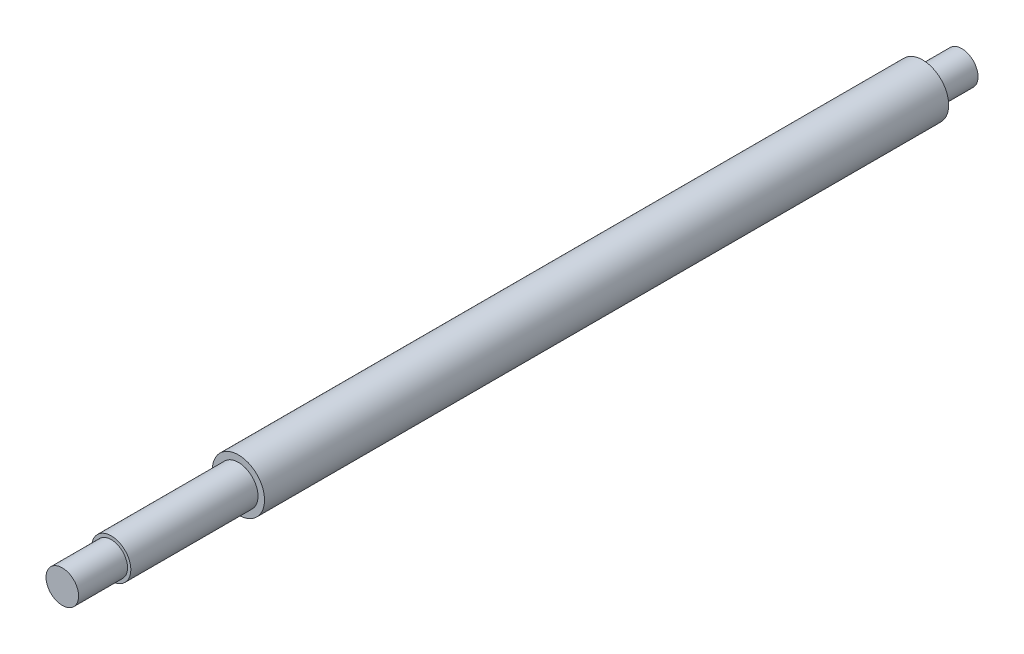
ISO-10303-21;
HEADER;
FILE_DESCRIPTION(('STEP AP214'),'2;1');
FILE_NAME('part.step','',(''),(''),'','','');
FILE_SCHEMA(('AUTOMOTIVE_DESIGN { 1 0 10303 214 1 1 1 1 }'));
ENDSEC;
DATA;
#1=APPLICATION_CONTEXT('core data for automotive mechanical design processes');
#2=APPLICATION_PROTOCOL_DEFINITION('international standard','automotive_design',2000,#1);
#3=PRODUCT_CONTEXT('',#1,'mechanical');
#4=PRODUCT('Part','Part','',(#3));
#5=PRODUCT_RELATED_PRODUCT_CATEGORY('part','',(#4));
#6=PRODUCT_DEFINITION_FORMATION('','',#4);
#7=PRODUCT_DEFINITION_CONTEXT('part definition',#1,'design');
#8=PRODUCT_DEFINITION('design','',#6,#7);
#9=PRODUCT_DEFINITION_SHAPE('','',#8);
#10=(LENGTH_UNIT() NAMED_UNIT(*) SI_UNIT(.MILLI.,.METRE.));
#11=(NAMED_UNIT(*) PLANE_ANGLE_UNIT() SI_UNIT($,.RADIAN.));
#12=(NAMED_UNIT(*) SI_UNIT($,.STERADIAN.) SOLID_ANGLE_UNIT());
#13=UNCERTAINTY_MEASURE_WITH_UNIT(LENGTH_MEASURE(1.E-05),#10,'distance_accuracy_value','');
#14=(GEOMETRIC_REPRESENTATION_CONTEXT(3) GLOBAL_UNCERTAINTY_ASSIGNED_CONTEXT((#13)) GLOBAL_UNIT_ASSIGNED_CONTEXT((#10,
#11,#12)) REPRESENTATION_CONTEXT('',''));
#15=CARTESIAN_POINT('',(0.,0.,0.));
#16=DIRECTION('',(0.,0.,1.));
#17=DIRECTION('',(1.,0.,0.));
#18=AXIS2_PLACEMENT_3D('',#15,#16,#17);
#19=CARTESIAN_POINT('',(0.,0.,275.75));
#20=DIRECTION('',(0.,0.,1.));
#21=DIRECTION('',(1.,0.,0.));
#22=AXIS2_PLACEMENT_3D('',#19,#20,#21);
#23=PLANE('',#22);
#24=CARTESIAN_POINT('',(0.,0.,275.75));
#25=DIRECTION('',(0.,0.,-1.));
#26=DIRECTION('',(-1.,0.,0.));
#27=AXIS2_PLACEMENT_3D('',#24,#25,#26);
#28=CIRCLE('',#27,4.99999999999995);
#29=CARTESIAN_POINT('',(-4.99999999999995,0.,275.75));
#30=VERTEX_POINT('',#29);
#31=EDGE_CURVE('E12',#30,#30,#28,.T.);
#32=ORIENTED_EDGE('',*,*,#31,.F.);
#33=EDGE_LOOP('',(#32));
#34=FACE_BOUND('',#33,.T.);
#35=ADVANCED_FACE('F45',(#34),#23,.T.);
#36=CARTESIAN_POINT('',(0.,0.,80.9253811370197));
#37=DIRECTION('',(0.,0.,-1.));
#38=DIRECTION('',(-1.,0.,0.));
#39=AXIS2_PLACEMENT_3D('',#36,#37,#38);
#40=CYLINDRICAL_SURFACE('',#39,4.99999999999995);
#41=ORIENTED_EDGE('',*,*,#31,.T.);
#42=EDGE_LOOP('',(#41));
#43=FACE_BOUND('',#42,.T.);
#44=CARTESIAN_POINT('',(0.,0.,260.75));
#45=DIRECTION('',(0.,0.,-1.));
#46=DIRECTION('',(-1.,0.,0.));
#47=AXIS2_PLACEMENT_3D('',#44,#45,#46);
#48=CIRCLE('',#47,4.99999999999995);
#49=CARTESIAN_POINT('',(-4.99999999999995,0.,260.75));
#50=VERTEX_POINT('',#49);
#51=EDGE_CURVE('E52',#50,#50,#48,.T.);
#52=ORIENTED_EDGE('',*,*,#51,.F.);
#53=EDGE_LOOP('',(#52));
#54=FACE_BOUND('',#53,.T.);
#55=ADVANCED_FACE('F101',(#43,#54),#40,.T.);
#56=CARTESIAN_POINT('',(0.,4.99999999999995,260.75));
#57=DIRECTION('',(0.,0.,1.));
#58=DIRECTION('',(1.,0.,0.));
#59=AXIS2_PLACEMENT_3D('',#56,#57,#58);
#60=PLANE('',#59);
#61=ORIENTED_EDGE('',*,*,#51,.T.);
#62=EDGE_LOOP('',(#61));
#63=FACE_BOUND('',#62,.T.);
#64=CARTESIAN_POINT('',(0.,0.,260.75));
#65=DIRECTION('',(0.,0.,-1.));
#66=DIRECTION('',(-1.,0.,0.));
#67=AXIS2_PLACEMENT_3D('',#64,#65,#66);
#68=CIRCLE('',#67,6.00000000000001);
#69=CARTESIAN_POINT('',(-6.00000000000001,0.,260.75));
#70=VERTEX_POINT('',#69);
#71=EDGE_CURVE('E57',#70,#70,#68,.T.);
#72=ORIENTED_EDGE('',*,*,#71,.F.);
#73=EDGE_LOOP('',(#72));
#74=FACE_BOUND('',#73,.T.);
#75=ADVANCED_FACE('F106',(#63,#74),#60,.T.);
#76=CARTESIAN_POINT('',(0.,0.,80.9253811370197));
#77=DIRECTION('',(0.,0.,-1.));
#78=DIRECTION('',(-1.,0.,0.));
#79=AXIS2_PLACEMENT_3D('',#76,#77,#78);
#80=CYLINDRICAL_SURFACE('',#79,6.00000000000001);
#81=ORIENTED_EDGE('',*,*,#71,.T.);
#82=EDGE_LOOP('',(#81));
#83=FACE_BOUND('',#82,.T.);
#84=CARTESIAN_POINT('',(0.,0.,221.75));
#85=DIRECTION('',(0.,0.,-1.));
#86=DIRECTION('',(-1.,0.,0.));
#87=AXIS2_PLACEMENT_3D('',#84,#85,#86);
#88=CIRCLE('',#87,6.00000000000001);
#89=CARTESIAN_POINT('',(-6.00000000000001,0.,221.75));
#90=VERTEX_POINT('',#89);
#91=EDGE_CURVE('E62',#90,#90,#88,.T.);
#92=ORIENTED_EDGE('',*,*,#91,.F.);
#93=EDGE_LOOP('',(#92));
#94=FACE_BOUND('',#93,.T.);
#95=ADVANCED_FACE('F110',(#83,#94),#80,.T.);
#96=CARTESIAN_POINT('',(0.,6.00000000000001,221.75));
#97=DIRECTION('',(0.,0.,1.));
#98=DIRECTION('',(1.,0.,0.));
#99=AXIS2_PLACEMENT_3D('',#96,#97,#98);
#100=PLANE('',#99);
#101=ORIENTED_EDGE('',*,*,#91,.T.);
#102=EDGE_LOOP('',(#101));
#103=FACE_BOUND('',#102,.T.);
#104=CARTESIAN_POINT('',(0.,0.,221.75));
#105=DIRECTION('',(0.,0.,-1.));
#106=DIRECTION('',(-1.,0.,0.));
#107=AXIS2_PLACEMENT_3D('',#104,#105,#106);
#108=CIRCLE('',#107,8.00000000000002);
#109=CARTESIAN_POINT('',(-8.00000000000002,0.,221.75));
#110=VERTEX_POINT('',#109);
#111=EDGE_CURVE('E68',#110,#110,#108,.T.);
#112=ORIENTED_EDGE('',*,*,#111,.F.);
#113=EDGE_LOOP('',(#112));
#114=FACE_BOUND('',#113,.T.);
#115=ADVANCED_FACE('F116',(#103,#114),#100,.T.);
#116=CARTESIAN_POINT('',(0.,0.,80.9253811370197));
#117=DIRECTION('',(0.,0.,-1.));
#118=DIRECTION('',(-1.,0.,0.));
#119=AXIS2_PLACEMENT_3D('',#116,#117,#118);
#120=CYLINDRICAL_SURFACE('',#119,8.00000000000002);
#121=ORIENTED_EDGE('',*,*,#111,.T.);
#122=EDGE_LOOP('',(#121));
#123=FACE_BOUND('',#122,.T.);
#124=CARTESIAN_POINT('',(0.,0.,12.));
#125=DIRECTION('',(0.,0.,-1.));
#126=DIRECTION('',(-1.,0.,0.));
#127=AXIS2_PLACEMENT_3D('',#124,#125,#126);
#128=CIRCLE('',#127,8.00000000000002);
#129=CARTESIAN_POINT('',(-8.00000000000002,0.,12.));
#130=VERTEX_POINT('',#129);
#131=EDGE_CURVE('E72',#130,#130,#128,.T.);
#132=ORIENTED_EDGE('',*,*,#131,.F.);
#133=EDGE_LOOP('',(#132));
#134=FACE_BOUND('',#133,.T.);
#135=ADVANCED_FACE('F97',(#123,#134),#120,.T.);
#136=CARTESIAN_POINT('',(0.,8.00000000000002,12.));
#137=DIRECTION('',(0.,0.,-1.));
#138=DIRECTION('',(-1.,0.,0.));
#139=AXIS2_PLACEMENT_3D('',#136,#137,#138);
#140=PLANE('',#139);
#141=ORIENTED_EDGE('',*,*,#131,.T.);
#142=EDGE_LOOP('',(#141));
#143=FACE_BOUND('',#142,.T.);
#144=CARTESIAN_POINT('',(0.,0.,12.));
#145=DIRECTION('',(0.,0.,-1.));
#146=DIRECTION('',(-1.,0.,0.));
#147=AXIS2_PLACEMENT_3D('',#144,#145,#146);
#148=CIRCLE('',#147,5.);
#149=CARTESIAN_POINT('',(-5.,0.,12.));
#150=VERTEX_POINT('',#149);
#151=EDGE_CURVE('E76',#150,#150,#148,.T.);
#152=ORIENTED_EDGE('',*,*,#151,.F.);
#153=EDGE_LOOP('',(#152));
#154=FACE_BOUND('',#153,.T.);
#155=ADVANCED_FACE('F89',(#143,#154),#140,.T.);
#156=CARTESIAN_POINT('',(0.,0.,80.9253811370197));
#157=DIRECTION('',(0.,0.,-1.));
#158=DIRECTION('',(-1.,0.,0.));
#159=AXIS2_PLACEMENT_3D('',#156,#157,#158);
#160=CYLINDRICAL_SURFACE('',#159,5.);
#161=ORIENTED_EDGE('',*,*,#151,.T.);
#162=EDGE_LOOP('',(#161));
#163=FACE_BOUND('',#162,.T.);
#164=CARTESIAN_POINT('',(0.,0.,0.));
#165=DIRECTION('',(0.,0.,-1.));
#166=DIRECTION('',(-1.,0.,0.));
#167=AXIS2_PLACEMENT_3D('',#164,#165,#166);
#168=CIRCLE('',#167,5.);
#169=CARTESIAN_POINT('',(-5.,0.,0.));
#170=VERTEX_POINT('',#169);
#171=EDGE_CURVE('E80',#170,#170,#168,.T.);
#172=ORIENTED_EDGE('',*,*,#171,.F.);
#173=EDGE_LOOP('',(#172));
#174=FACE_BOUND('',#173,.T.);
#175=ADVANCED_FACE('F87',(#163,#174),#160,.T.);
#176=CARTESIAN_POINT('',(0.,5.,0.));
#177=DIRECTION('',(0.,0.,-1.));
#178=DIRECTION('',(-1.,0.,0.));
#179=AXIS2_PLACEMENT_3D('',#176,#177,#178);
#180=PLANE('',#179);
#181=ORIENTED_EDGE('',*,*,#171,.T.);
#182=EDGE_LOOP('',(#181));
#183=FACE_BOUND('',#182,.T.);
#184=ADVANCED_FACE('F85',(#183),#180,.T.);
#185=CLOSED_SHELL('',(#35,#55,#75,#95,#115,#135,#155,#175,#184));
#186=MANIFOLD_SOLID_BREP('B2',#185);
#187=ADVANCED_BREP_SHAPE_REPRESENTATION('',(#18,#186),#14);
#188=SHAPE_DEFINITION_REPRESENTATION(#9,#187);
ENDSEC;
END-ISO-10303-21;
